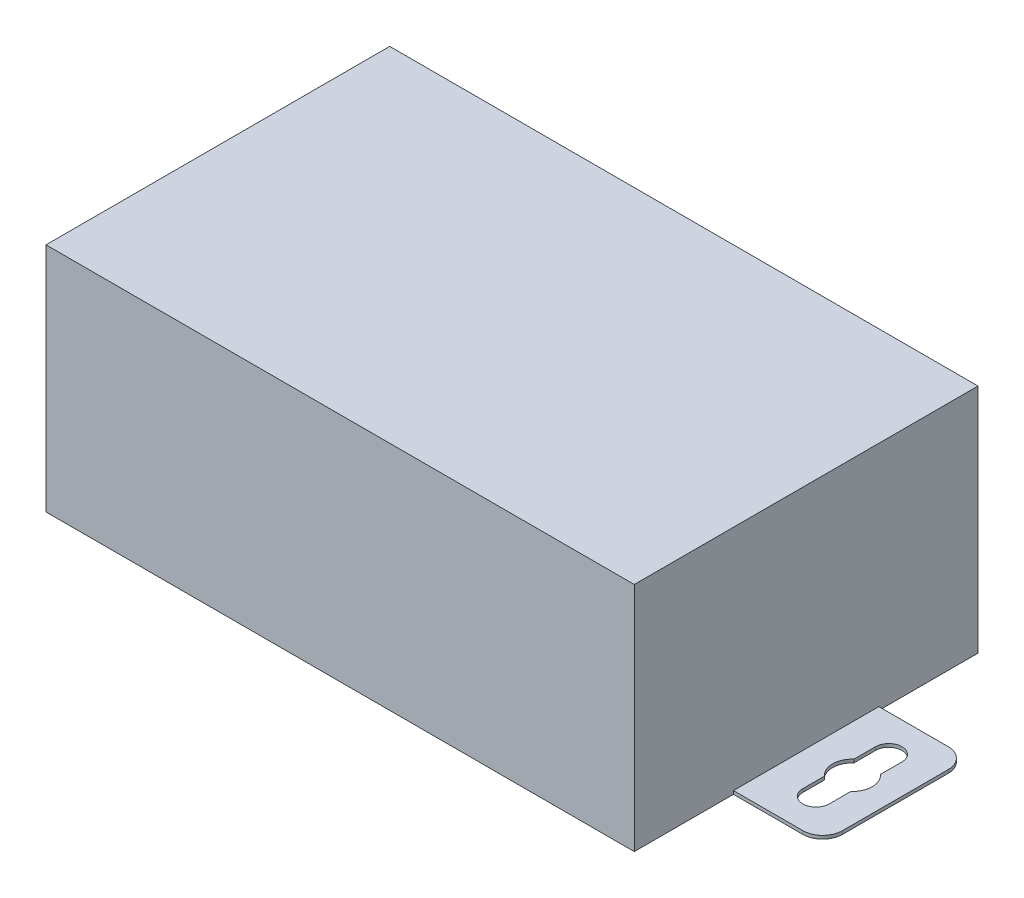
ISO-10303-21;
HEADER;
FILE_DESCRIPTION(('STEP AP214'),'2;1');
FILE_NAME('part.step','',(''),(''),'','','');
FILE_SCHEMA(('AUTOMOTIVE_DESIGN { 1 0 10303 214 1 1 1 1 }'));
ENDSEC;
DATA;
#1=APPLICATION_CONTEXT('core data for automotive mechanical design processes');
#2=APPLICATION_PROTOCOL_DEFINITION('international standard','automotive_design',2000,#1);
#3=PRODUCT_CONTEXT('',#1,'mechanical');
#4=PRODUCT('Part','Part','',(#3));
#5=PRODUCT_RELATED_PRODUCT_CATEGORY('part','',(#4));
#6=PRODUCT_DEFINITION_FORMATION('','',#4);
#7=PRODUCT_DEFINITION_CONTEXT('part definition',#1,'design');
#8=PRODUCT_DEFINITION('design','',#6,#7);
#9=PRODUCT_DEFINITION_SHAPE('','',#8);
#10=(LENGTH_UNIT() NAMED_UNIT(*) SI_UNIT(.MILLI.,.METRE.));
#11=(NAMED_UNIT(*) PLANE_ANGLE_UNIT() SI_UNIT($,.RADIAN.));
#12=(NAMED_UNIT(*) SI_UNIT($,.STERADIAN.) SOLID_ANGLE_UNIT());
#13=UNCERTAINTY_MEASURE_WITH_UNIT(LENGTH_MEASURE(1.E-05),#10,'distance_accuracy_value','');
#14=(GEOMETRIC_REPRESENTATION_CONTEXT(3) GLOBAL_UNCERTAINTY_ASSIGNED_CONTEXT((#13)) GLOBAL_UNIT_ASSIGNED_CONTEXT((#10,
#11,#12)) REPRESENTATION_CONTEXT('',''));
#15=CARTESIAN_POINT('',(0.,0.,0.));
#16=DIRECTION('',(0.,0.,1.));
#17=DIRECTION('',(1.,0.,0.));
#18=AXIS2_PLACEMENT_3D('',#15,#16,#17);
#19=CARTESIAN_POINT('',(0.,35.,0.));
#20=DIRECTION('',(1.,0.,0.));
#21=DIRECTION('',(0.,0.,-1.));
#22=AXIS2_PLACEMENT_3D('',#19,#20,#21);
#23=PLANE('',#22);
#24=DIRECTION('',(0.,0.,1.));
#25=VECTOR('',#24,1.);
#26=CARTESIAN_POINT('',(0.,0.,0.));
#27=LINE('',#26,#25);
#28=CARTESIAN_POINT('',(0.,0.,-52.));
#29=VERTEX_POINT('',#28);
#30=CARTESIAN_POINT('',(0.,0.,-37.));
#31=VERTEX_POINT('',#30);
#32=EDGE_CURVE('E562',#29,#31,#27,.T.);
#33=ORIENTED_EDGE('',*,*,#32,.T.);
#34=DIRECTION('',(0.,1.,0.));
#35=VECTOR('',#34,1.);
#36=CARTESIAN_POINT('',(0.,35.,-37.));
#37=LINE('',#36,#35);
#38=CARTESIAN_POINT('',(0.,0.5,-37.));
#39=VERTEX_POINT('',#38);
#40=EDGE_CURVE('E543',#31,#39,#37,.T.);
#41=ORIENTED_EDGE('',*,*,#40,.T.);
#42=DIRECTION('',(0.,0.,1.));
#43=VECTOR('',#42,1.);
#44=CARTESIAN_POINT('',(0.,0.5,0.));
#45=LINE('',#44,#43);
#46=CARTESIAN_POINT('',(0.,0.5,-15.));
#47=VERTEX_POINT('',#46);
#48=EDGE_CURVE('E47',#39,#47,#45,.T.);
#49=ORIENTED_EDGE('',*,*,#48,.T.);
#50=DIRECTION('',(0.,-1.,0.));
#51=VECTOR('',#50,1.);
#52=CARTESIAN_POINT('',(0.,35.,-15.));
#53=LINE('',#52,#51);
#54=CARTESIAN_POINT('',(0.,0.,-15.));
#55=VERTEX_POINT('',#54);
#56=EDGE_CURVE('E530',#47,#55,#53,.T.);
#57=ORIENTED_EDGE('',*,*,#56,.T.);
#58=CARTESIAN_POINT('',(0.,0.,0.));
#59=VERTEX_POINT('',#58);
#60=EDGE_CURVE('E546',#55,#59,#27,.T.);
#61=ORIENTED_EDGE('',*,*,#60,.T.);
#62=DIRECTION('',(0.,-1.,0.));
#63=VECTOR('',#62,1.);
#64=CARTESIAN_POINT('',(0.,35.,0.));
#65=LINE('',#64,#63);
#66=CARTESIAN_POINT('',(0.,35.,0.));
#67=VERTEX_POINT('',#66);
#68=EDGE_CURVE('E585',#67,#59,#65,.T.);
#69=ORIENTED_EDGE('',*,*,#68,.F.);
#70=DIRECTION('',(0.,0.,1.));
#71=VECTOR('',#70,1.);
#72=CARTESIAN_POINT('',(0.,35.,0.));
#73=LINE('',#72,#71);
#74=CARTESIAN_POINT('',(0.,35.,-52.));
#75=VERTEX_POINT('',#74);
#76=EDGE_CURVE('E547',#75,#67,#73,.T.);
#77=ORIENTED_EDGE('',*,*,#76,.F.);
#78=DIRECTION('',(0.,-1.,0.));
#79=VECTOR('',#78,1.);
#80=CARTESIAN_POINT('',(0.,35.,-52.));
#81=LINE('',#80,#79);
#82=EDGE_CURVE('E561',#75,#29,#81,.T.);
#83=ORIENTED_EDGE('',*,*,#82,.T.);
#84=EDGE_LOOP('',(#33,#41,#49,#57,#61,#69,#77,#83));
#85=FACE_BOUND('',#84,.T.);
#86=ADVANCED_FACE('F39',(#85),#23,.F.);
#87=CARTESIAN_POINT('',(0.,35.,0.));
#88=DIRECTION('',(0.,0.,-1.));
#89=DIRECTION('',(-1.,0.,0.));
#90=AXIS2_PLACEMENT_3D('',#87,#88,#89);
#91=PLANE('',#90);
#92=DIRECTION('',(1.,0.,0.));
#93=VECTOR('',#92,1.);
#94=CARTESIAN_POINT('',(0.,0.,0.));
#95=LINE('',#94,#93);
#96=CARTESIAN_POINT('',(89.,0.,0.));
#97=VERTEX_POINT('',#96);
#98=EDGE_CURVE('E565',#59,#97,#95,.T.);
#99=ORIENTED_EDGE('',*,*,#98,.T.);
#100=DIRECTION('',(0.,-1.,0.));
#101=VECTOR('',#100,1.);
#102=CARTESIAN_POINT('',(89.,35.,0.));
#103=LINE('',#102,#101);
#104=CARTESIAN_POINT('',(89.,35.,0.));
#105=VERTEX_POINT('',#104);
#106=EDGE_CURVE('E581',#105,#97,#103,.T.);
#107=ORIENTED_EDGE('',*,*,#106,.F.);
#108=DIRECTION('',(1.,0.,0.));
#109=VECTOR('',#108,1.);
#110=CARTESIAN_POINT('',(0.,35.,0.));
#111=LINE('',#110,#109);
#112=EDGE_CURVE('E551',#67,#105,#111,.T.);
#113=ORIENTED_EDGE('',*,*,#112,.F.);
#114=ORIENTED_EDGE('',*,*,#68,.T.);
#115=EDGE_LOOP('',(#99,#107,#113,#114));
#116=FACE_BOUND('',#115,.T.);
#117=ADVANCED_FACE('F645',(#116),#91,.F.);
#118=CARTESIAN_POINT('',(89.,35.,0.));
#119=DIRECTION('',(-1.,0.,0.));
#120=DIRECTION('',(0.,0.,1.));
#121=AXIS2_PLACEMENT_3D('',#118,#119,#120);
#122=PLANE('',#121);
#123=DIRECTION('',(0.,0.,1.));
#124=VECTOR('',#123,1.);
#125=CARTESIAN_POINT('',(89.,0.5,0.));
#126=LINE('',#125,#124);
#127=CARTESIAN_POINT('',(89.,0.5,-36.9999999999998));
#128=VERTEX_POINT('',#127);
#129=CARTESIAN_POINT('',(89.,0.5,-14.9999999999995));
#130=VERTEX_POINT('',#129);
#131=EDGE_CURVE('E11',#128,#130,#126,.T.);
#132=ORIENTED_EDGE('',*,*,#131,.F.);
#133=DIRECTION('',(0.,-1.,0.));
#134=VECTOR('',#133,1.);
#135=CARTESIAN_POINT('',(89.,35.,-36.9999999999997));
#136=LINE('',#135,#134);
#137=CARTESIAN_POINT('',(89.,0.,-36.9999999999997));
#138=VERTEX_POINT('',#137);
#139=EDGE_CURVE('E397',#128,#138,#136,.T.);
#140=ORIENTED_EDGE('',*,*,#139,.T.);
#141=DIRECTION('',(0.,0.,-1.));
#142=VECTOR('',#141,1.);
#143=CARTESIAN_POINT('',(89.,0.,0.));
#144=LINE('',#143,#142);
#145=CARTESIAN_POINT('',(89.,0.,-52.));
#146=VERTEX_POINT('',#145);
#147=EDGE_CURVE('E568',#138,#146,#144,.T.);
#148=ORIENTED_EDGE('',*,*,#147,.T.);
#149=DIRECTION('',(0.,-1.,0.));
#150=VECTOR('',#149,1.);
#151=CARTESIAN_POINT('',(89.,35.,-52.));
#152=LINE('',#151,#150);
#153=CARTESIAN_POINT('',(89.,35.,-52.));
#154=VERTEX_POINT('',#153);
#155=EDGE_CURVE('E577',#154,#146,#152,.T.);
#156=ORIENTED_EDGE('',*,*,#155,.F.);
#157=DIRECTION('',(0.,0.,-1.));
#158=VECTOR('',#157,1.);
#159=CARTESIAN_POINT('',(89.,35.,0.));
#160=LINE('',#159,#158);
#161=EDGE_CURVE('E555',#105,#154,#160,.T.);
#162=ORIENTED_EDGE('',*,*,#161,.F.);
#163=ORIENTED_EDGE('',*,*,#106,.T.);
#164=CARTESIAN_POINT('',(89.,0.,-14.9999999999997));
#165=VERTEX_POINT('',#164);
#166=EDGE_CURVE('E569',#97,#165,#144,.T.);
#167=ORIENTED_EDGE('',*,*,#166,.T.);
#168=DIRECTION('',(0.,1.,0.));
#169=VECTOR('',#168,1.);
#170=CARTESIAN_POINT('',(89.,35.,-14.9999999999997));
#171=LINE('',#170,#169);
#172=EDGE_CURVE('E54',#165,#130,#171,.T.);
#173=ORIENTED_EDGE('',*,*,#172,.T.);
#174=EDGE_LOOP('',(#132,#140,#148,#156,#162,#163,#167,#173));
#175=FACE_BOUND('',#174,.T.);
#176=ADVANCED_FACE('F617',(#175),#122,.F.);
#177=CARTESIAN_POINT('',(0.,35.,-52.));
#178=DIRECTION('',(0.,0.,1.));
#179=DIRECTION('',(1.,0.,0.));
#180=AXIS2_PLACEMENT_3D('',#177,#178,#179);
#181=PLANE('',#180);
#182=DIRECTION('',(-1.,0.,0.));
#183=VECTOR('',#182,1.);
#184=CARTESIAN_POINT('',(0.,0.,-52.));
#185=LINE('',#184,#183);
#186=EDGE_CURVE('E552',#146,#29,#185,.T.);
#187=ORIENTED_EDGE('',*,*,#186,.T.);
#188=ORIENTED_EDGE('',*,*,#82,.F.);
#189=DIRECTION('',(-1.,0.,0.));
#190=VECTOR('',#189,1.);
#191=CARTESIAN_POINT('',(0.,35.,-52.));
#192=LINE('',#191,#190);
#193=EDGE_CURVE('E558',#154,#75,#192,.T.);
#194=ORIENTED_EDGE('',*,*,#193,.F.);
#195=ORIENTED_EDGE('',*,*,#155,.T.);
#196=EDGE_LOOP('',(#187,#188,#194,#195));
#197=FACE_BOUND('',#196,.T.);
#198=ADVANCED_FACE('F623',(#197),#181,.F.);
#199=CARTESIAN_POINT('',(0.,35.,0.));
#200=DIRECTION('',(0.,-1.,0.));
#201=DIRECTION('',(0.,0.,-1.));
#202=AXIS2_PLACEMENT_3D('',#199,#200,#201);
#203=PLANE('',#202);
#204=ORIENTED_EDGE('',*,*,#76,.T.);
#205=ORIENTED_EDGE('',*,*,#112,.T.);
#206=ORIENTED_EDGE('',*,*,#161,.T.);
#207=ORIENTED_EDGE('',*,*,#193,.T.);
#208=EDGE_LOOP('',(#204,#205,#206,#207));
#209=FACE_BOUND('',#208,.T.);
#210=ADVANCED_FACE('F657',(#209),#203,.F.);
#211=CARTESIAN_POINT('',(0.,0.,0.));
#212=DIRECTION('',(0.,-1.,0.));
#213=DIRECTION('',(0.,0.,-1.));
#214=AXIS2_PLACEMENT_3D('',#211,#212,#213);
#215=PLANE('',#214);
#216=ORIENTED_EDGE('',*,*,#147,.F.);
#217=DIRECTION('',(1.,0.,0.));
#218=VECTOR('',#217,1.);
#219=CARTESIAN_POINT('',(99.5000000000002,0.,-36.9999999999996));
#220=LINE('',#219,#218);
#221=CARTESIAN_POINT('',(99.5000000000002,0.,-36.9999999999996));
#222=VERTEX_POINT('',#221);
#223=EDGE_CURVE('E327',#138,#222,#220,.T.);
#224=ORIENTED_EDGE('',*,*,#223,.T.);
#225=CARTESIAN_POINT('',(99.5000000000002,0.,-33.9999999999996));
#226=DIRECTION('',(0.,-1.,0.));
#227=DIRECTION('',(0.,0.,-1.));
#228=AXIS2_PLACEMENT_3D('',#225,#226,#227);
#229=CIRCLE('',#228,3.00000000000001);
#230=CARTESIAN_POINT('',(102.5,0.,-33.9999999999995));
#231=VERTEX_POINT('',#230);
#232=EDGE_CURVE('E368',#222,#231,#229,.T.);
#233=ORIENTED_EDGE('',*,*,#232,.T.);
#234=DIRECTION('',(0.,0.,1.));
#235=VECTOR('',#234,1.);
#236=CARTESIAN_POINT('',(102.5,0.,-33.9999999999995));
#237=LINE('',#236,#235);
#238=CARTESIAN_POINT('',(102.5,0.,-17.9999999999996));
#239=VERTEX_POINT('',#238);
#240=EDGE_CURVE('E372',#231,#239,#237,.T.);
#241=ORIENTED_EDGE('',*,*,#240,.T.);
#242=CARTESIAN_POINT('',(99.5000000000001,0.,-17.9999999999996));
#243=DIRECTION('',(0.,-1.,0.));
#244=DIRECTION('',(0.,0.,-1.));
#245=AXIS2_PLACEMENT_3D('',#242,#243,#244);
#246=CIRCLE('',#245,3.00000000000001);
#247=CARTESIAN_POINT('',(99.5000000000001,0.,-14.9999999999996));
#248=VERTEX_POINT('',#247);
#249=EDGE_CURVE('E376',#239,#248,#246,.T.);
#250=ORIENTED_EDGE('',*,*,#249,.T.);
#251=DIRECTION('',(-1.,0.,0.));
#252=VECTOR('',#251,1.);
#253=CARTESIAN_POINT('',(99.5000000000001,0.,-14.9999999999996));
#254=LINE('',#253,#252);
#255=EDGE_CURVE('E349',#248,#165,#254,.T.);
#256=ORIENTED_EDGE('',*,*,#255,.T.);
#257=ORIENTED_EDGE('',*,*,#166,.F.);
#258=ORIENTED_EDGE('',*,*,#98,.F.);
#259=ORIENTED_EDGE('',*,*,#60,.F.);
#260=DIRECTION('',(-1.,0.,0.));
#261=VECTOR('',#260,1.);
#262=CARTESIAN_POINT('',(-10.5,0.,-15.));
#263=LINE('',#262,#261);
#264=CARTESIAN_POINT('',(-10.5,0.,-15.));
#265=VERTEX_POINT('',#264);
#266=EDGE_CURVE('E467',#55,#265,#263,.T.);
#267=ORIENTED_EDGE('',*,*,#266,.T.);
#268=CARTESIAN_POINT('',(-10.5,0.,-18.));
#269=DIRECTION('',(0.,-1.,0.));
#270=DIRECTION('',(0.,0.,1.));
#271=AXIS2_PLACEMENT_3D('',#268,#269,#270);
#272=CIRCLE('',#271,3.);
#273=CARTESIAN_POINT('',(-13.5,0.,-18.));
#274=VERTEX_POINT('',#273);
#275=EDGE_CURVE('E512',#265,#274,#272,.T.);
#276=ORIENTED_EDGE('',*,*,#275,.T.);
#277=DIRECTION('',(0.,0.,-1.));
#278=VECTOR('',#277,1.);
#279=CARTESIAN_POINT('',(-13.5,0.,-34.));
#280=LINE('',#279,#278);
#281=CARTESIAN_POINT('',(-13.5,0.,-34.));
#282=VERTEX_POINT('',#281);
#283=EDGE_CURVE('E516',#274,#282,#280,.T.);
#284=ORIENTED_EDGE('',*,*,#283,.T.);
#285=CARTESIAN_POINT('',(-10.5,0.,-34.));
#286=DIRECTION('',(0.,-1.,0.));
#287=DIRECTION('',(0.,0.,1.));
#288=AXIS2_PLACEMENT_3D('',#285,#286,#287);
#289=CIRCLE('',#288,3.);
#290=CARTESIAN_POINT('',(-10.5,0.,-37.));
#291=VERTEX_POINT('',#290);
#292=EDGE_CURVE('E520',#282,#291,#289,.T.);
#293=ORIENTED_EDGE('',*,*,#292,.T.);
#294=DIRECTION('',(1.,0.,0.));
#295=VECTOR('',#294,1.);
#296=CARTESIAN_POINT('',(-10.5,0.,-37.));
#297=LINE('',#296,#295);
#298=EDGE_CURVE('E493',#291,#31,#297,.T.);
#299=ORIENTED_EDGE('',*,*,#298,.T.);
#300=ORIENTED_EDGE('',*,*,#32,.F.);
#301=ORIENTED_EDGE('',*,*,#186,.F.);
#302=EDGE_LOOP('',(#216,#224,#233,#241,#250,#256,#257,#258,#259,#267,#276,#284,#293,#299,#300,#301));
#303=FACE_BOUND('',#302,.T.);
#304=DIRECTION('',(0.,0.,-1.));
#305=VECTOR('',#304,1.);
#306=CARTESIAN_POINT('',(-9.,0.,-20.5));
#307=LINE('',#306,#305);
#308=CARTESIAN_POINT('',(-9.,0.,-20.5));
#309=VERTEX_POINT('',#308);
#310=CARTESIAN_POINT('',(-9.,0.,-23.7639320225002));
#311=VERTEX_POINT('',#310);
#312=EDGE_CURVE('E437',#309,#311,#307,.T.);
#313=ORIENTED_EDGE('',*,*,#312,.F.);
#314=CARTESIAN_POINT('',(-7.,0.,-20.4999999999998));
#315=DIRECTION('',(0.,-1.,0.));
#316=DIRECTION('',(0.,0.,-1.));
#317=AXIS2_PLACEMENT_3D('',#314,#315,#316);
#318=CIRCLE('',#317,2.);
#319=CARTESIAN_POINT('',(-5.,0.,-20.5));
#320=VERTEX_POINT('',#319);
#321=EDGE_CURVE('E400',#320,#309,#318,.T.);
#322=ORIENTED_EDGE('',*,*,#321,.F.);
#323=DIRECTION('',(0.,0.,1.));
#324=VECTOR('',#323,1.);
#325=CARTESIAN_POINT('',(-5.,0.,-20.5));
#326=LINE('',#325,#324);
#327=CARTESIAN_POINT('',(-5.,0.,-23.7639320225002));
#328=VERTEX_POINT('',#327);
#329=EDGE_CURVE('E406',#328,#320,#326,.T.);
#330=ORIENTED_EDGE('',*,*,#329,.F.);
#331=CARTESIAN_POINT('',(-7.,0.,-26.));
#332=DIRECTION('',(0.,-1.,0.));
#333=DIRECTION('',(0.,0.,-1.));
#334=AXIS2_PLACEMENT_3D('',#331,#332,#333);
#335=CIRCLE('',#334,3.);
#336=CARTESIAN_POINT('',(-4.99999999999865,0.,-28.2360679774986));
#337=VERTEX_POINT('',#336);
#338=EDGE_CURVE('E457',#337,#328,#335,.T.);
#339=ORIENTED_EDGE('',*,*,#338,.F.);
#340=DIRECTION('',(4.13493557771965E-13,0.,1.));
#341=VECTOR('',#340,1.);
#342=CARTESIAN_POINT('',(-4.99999999999865,0.,-28.2360679774986));
#343=LINE('',#342,#341);
#344=CARTESIAN_POINT('',(-5.,0.,-31.5));
#345=VERTEX_POINT('',#344);
#346=EDGE_CURVE('E453',#345,#337,#343,.T.);
#347=ORIENTED_EDGE('',*,*,#346,.F.);
#348=CARTESIAN_POINT('',(-7.,0.,-31.5));
#349=DIRECTION('',(0.,-1.,0.));
#350=DIRECTION('',(0.,0.,-1.));
#351=AXIS2_PLACEMENT_3D('',#348,#349,#350);
#352=CIRCLE('',#351,2.);
#353=CARTESIAN_POINT('',(-9.,0.,-31.5));
#354=VERTEX_POINT('',#353);
#355=EDGE_CURVE('E449',#354,#345,#352,.T.);
#356=ORIENTED_EDGE('',*,*,#355,.F.);
#357=DIRECTION('',(0.,0.,-1.));
#358=VECTOR('',#357,1.);
#359=CARTESIAN_POINT('',(-9.,0.,-28.2360679774998));
#360=LINE('',#359,#358);
#361=CARTESIAN_POINT('',(-9.,0.,-28.2360679774998));
#362=VERTEX_POINT('',#361);
#363=EDGE_CURVE('E445',#362,#354,#360,.T.);
#364=ORIENTED_EDGE('',*,*,#363,.F.);
#365=CARTESIAN_POINT('',(-7.,0.,-26.));
#366=DIRECTION('',(0.,-1.,0.));
#367=DIRECTION('',(0.,0.,-1.));
#368=AXIS2_PLACEMENT_3D('',#365,#366,#367);
#369=CIRCLE('',#368,3.);
#370=EDGE_CURVE('E441',#311,#362,#369,.T.);
#371=ORIENTED_EDGE('',*,*,#370,.F.);
#372=EDGE_LOOP('',(#313,#322,#330,#339,#347,#356,#364,#371));
#373=FACE_BOUND('',#372,.T.);
#374=CARTESIAN_POINT('',(96.0000000000002,0.,-25.9999999999996));
#375=DIRECTION('',(0.,-1.,0.));
#376=DIRECTION('',(0.,0.,1.));
#377=AXIS2_PLACEMENT_3D('',#374,#375,#376);
#378=CIRCLE('',#377,3.);
#379=CARTESIAN_POINT('',(94.0000000000002,0.,-23.7639320224998));
#380=VERTEX_POINT('',#379);
#381=CARTESIAN_POINT('',(93.9999999999988,0.,-28.2360679774981));
#382=VERTEX_POINT('',#381);
#383=EDGE_CURVE('E252',#380,#382,#378,.T.);
#384=ORIENTED_EDGE('',*,*,#383,.F.);
#385=DIRECTION('',(0.,0.,-1.));
#386=VECTOR('',#385,1.);
#387=CARTESIAN_POINT('',(94.0000000000001,0.,-20.4999999999996));
#388=LINE('',#387,#386);
#389=CARTESIAN_POINT('',(94.0000000000001,0.,-20.4999999999996));
#390=VERTEX_POINT('',#389);
#391=EDGE_CURVE('E274',#390,#380,#388,.T.);
#392=ORIENTED_EDGE('',*,*,#391,.F.);
#393=CARTESIAN_POINT('',(96.0000000000001,0.,-20.4999999999993));
#394=DIRECTION('',(0.,-1.,0.));
#395=DIRECTION('',(0.,0.,1.));
#396=AXIS2_PLACEMENT_3D('',#393,#394,#395);
#397=CIRCLE('',#396,2.00000000000001);
#398=CARTESIAN_POINT('',(98.0000000000001,0.,-20.4999999999996));
#399=VERTEX_POINT('',#398);
#400=EDGE_CURVE('E278',#399,#390,#397,.T.);
#401=ORIENTED_EDGE('',*,*,#400,.F.);
#402=DIRECTION('',(0.,0.,1.));
#403=VECTOR('',#402,1.);
#404=CARTESIAN_POINT('',(98.0000000000001,0.,-20.4999999999996));
#405=LINE('',#404,#403);
#406=CARTESIAN_POINT('',(98.0000000000002,0.,-23.7639320224998));
#407=VERTEX_POINT('',#406);
#408=EDGE_CURVE('E317',#407,#399,#405,.T.);
#409=ORIENTED_EDGE('',*,*,#408,.F.);
#410=CARTESIAN_POINT('',(96.0000000000002,0.,-25.9999999999996));
#411=DIRECTION('',(0.,-1.,0.));
#412=DIRECTION('',(0.,0.,1.));
#413=AXIS2_PLACEMENT_3D('',#410,#411,#412);
#414=CIRCLE('',#413,3.00000000000001);
#415=CARTESIAN_POINT('',(98.0000000000002,0.,-28.2360679774993));
#416=VERTEX_POINT('',#415);
#417=EDGE_CURVE('E313',#416,#407,#414,.T.);
#418=ORIENTED_EDGE('',*,*,#417,.F.);
#419=DIRECTION('',(0.,0.,1.));
#420=VECTOR('',#419,1.);
#421=CARTESIAN_POINT('',(98.0000000000002,0.,-28.2360679774993));
#422=LINE('',#421,#420);
#423=CARTESIAN_POINT('',(98.0000000000002,0.,-31.4999999999996));
#424=VERTEX_POINT('',#423);
#425=EDGE_CURVE('E309',#424,#416,#422,.T.);
#426=ORIENTED_EDGE('',*,*,#425,.F.);
#427=CARTESIAN_POINT('',(96.0000000000002,0.,-31.4999999999996));
#428=DIRECTION('',(0.,-1.,0.));
#429=DIRECTION('',(0.,0.,1.));
#430=AXIS2_PLACEMENT_3D('',#427,#428,#429);
#431=CIRCLE('',#430,2.00000000000001);
#432=CARTESIAN_POINT('',(94.0000000000002,0.,-31.4999999999996));
#433=VERTEX_POINT('',#432);
#434=EDGE_CURVE('E305',#433,#424,#431,.T.);
#435=ORIENTED_EDGE('',*,*,#434,.F.);
#436=DIRECTION('',(4.20934315880972E-13,0.,-1.));
#437=VECTOR('',#436,1.);
#438=CARTESIAN_POINT('',(93.9999999999988,0.,-28.2360679774981));
#439=LINE('',#438,#437);
#440=EDGE_CURVE('E302',#382,#433,#439,.T.);
#441=ORIENTED_EDGE('',*,*,#440,.F.);
#442=EDGE_LOOP('',(#384,#392,#401,#409,#418,#426,#435,#441));
#443=FACE_BOUND('',#442,.T.);
#444=ADVANCED_FACE('F609',(#303,#373,#443),#215,.T.);
#445=CARTESIAN_POINT('',(-10.5,0.5,-18.));
#446=DIRECTION('',(0.,1.,0.));
#447=DIRECTION('',(0.,0.,1.));
#448=AXIS2_PLACEMENT_3D('',#445,#446,#447);
#449=PLANE('',#448);
#450=CARTESIAN_POINT('',(-7.,0.5,-20.4999999999998));
#451=DIRECTION('',(0.,-1.,0.));
#452=DIRECTION('',(0.,0.,-1.));
#453=AXIS2_PLACEMENT_3D('',#450,#451,#452);
#454=CIRCLE('',#453,2.);
#455=CARTESIAN_POINT('',(-5.,0.5,-20.5));
#456=VERTEX_POINT('',#455);
#457=CARTESIAN_POINT('',(-9.,0.5,-20.5));
#458=VERTEX_POINT('',#457);
#459=EDGE_CURVE('E401',#456,#458,#454,.T.);
#460=ORIENTED_EDGE('',*,*,#459,.T.);
#461=DIRECTION('',(0.,0.,-1.));
#462=VECTOR('',#461,1.);
#463=CARTESIAN_POINT('',(-9.,0.5,-20.5));
#464=LINE('',#463,#462);
#465=CARTESIAN_POINT('',(-9.,0.5,-23.7639320225002));
#466=VERTEX_POINT('',#465);
#467=EDGE_CURVE('E405',#458,#466,#464,.T.);
#468=ORIENTED_EDGE('',*,*,#467,.T.);
#469=CARTESIAN_POINT('',(-7.,0.5,-26.));
#470=DIRECTION('',(0.,-1.,0.));
#471=DIRECTION('',(0.,0.,-1.));
#472=AXIS2_PLACEMENT_3D('',#469,#470,#471);
#473=CIRCLE('',#472,3.);
#474=CARTESIAN_POINT('',(-9.,0.5,-28.2360679774998));
#475=VERTEX_POINT('',#474);
#476=EDGE_CURVE('E410',#466,#475,#473,.T.);
#477=ORIENTED_EDGE('',*,*,#476,.T.);
#478=DIRECTION('',(0.,0.,-1.));
#479=VECTOR('',#478,1.);
#480=CARTESIAN_POINT('',(-9.,0.5,-28.2360679774998));
#481=LINE('',#480,#479);
#482=CARTESIAN_POINT('',(-9.,0.5,-31.5));
#483=VERTEX_POINT('',#482);
#484=EDGE_CURVE('E414',#475,#483,#481,.T.);
#485=ORIENTED_EDGE('',*,*,#484,.T.);
#486=CARTESIAN_POINT('',(-7.,0.5,-31.5));
#487=DIRECTION('',(0.,-1.,0.));
#488=DIRECTION('',(0.,0.,-1.));
#489=AXIS2_PLACEMENT_3D('',#486,#487,#488);
#490=CIRCLE('',#489,2.);
#491=CARTESIAN_POINT('',(-5.,0.5,-31.5));
#492=VERTEX_POINT('',#491);
#493=EDGE_CURVE('E418',#483,#492,#490,.T.);
#494=ORIENTED_EDGE('',*,*,#493,.T.);
#495=DIRECTION('',(4.13493557771965E-13,0.,1.));
#496=VECTOR('',#495,1.);
#497=CARTESIAN_POINT('',(-4.99999999999865,0.5,-28.2360679774986));
#498=LINE('',#497,#496);
#499=CARTESIAN_POINT('',(-4.99999999999865,0.5,-28.2360679774986));
#500=VERTEX_POINT('',#499);
#501=EDGE_CURVE('E422',#492,#500,#498,.T.);
#502=ORIENTED_EDGE('',*,*,#501,.T.);
#503=CARTESIAN_POINT('',(-7.,0.5,-26.));
#504=DIRECTION('',(0.,-1.,0.));
#505=DIRECTION('',(0.,0.,-1.));
#506=AXIS2_PLACEMENT_3D('',#503,#504,#505);
#507=CIRCLE('',#506,3.);
#508=CARTESIAN_POINT('',(-5.,0.5,-23.7639320225002));
#509=VERTEX_POINT('',#508);
#510=EDGE_CURVE('E426',#500,#509,#507,.T.);
#511=ORIENTED_EDGE('',*,*,#510,.T.);
#512=DIRECTION('',(0.,0.,1.));
#513=VECTOR('',#512,1.);
#514=CARTESIAN_POINT('',(-5.,0.5,-20.5));
#515=LINE('',#514,#513);
#516=EDGE_CURVE('E430',#509,#456,#515,.T.);
#517=ORIENTED_EDGE('',*,*,#516,.T.);
#518=EDGE_LOOP('',(#460,#468,#477,#485,#494,#502,#511,#517));
#519=FACE_BOUND('',#518,.T.);
#520=ORIENTED_EDGE('',*,*,#48,.F.);
#521=DIRECTION('',(1.,0.,0.));
#522=VECTOR('',#521,1.);
#523=CARTESIAN_POINT('',(-10.5,0.5,-37.));
#524=LINE('',#523,#522);
#525=CARTESIAN_POINT('',(-10.5,0.5,-37.));
#526=VERTEX_POINT('',#525);
#527=EDGE_CURVE('E505',#526,#39,#524,.T.);
#528=ORIENTED_EDGE('',*,*,#527,.F.);
#529=CARTESIAN_POINT('',(-10.5,0.5,-34.));
#530=DIRECTION('',(0.,-1.,0.));
#531=DIRECTION('',(0.,0.,1.));
#532=AXIS2_PLACEMENT_3D('',#529,#530,#531);
#533=CIRCLE('',#532,3.);
#534=CARTESIAN_POINT('',(-13.5,0.5,-34.));
#535=VERTEX_POINT('',#534);
#536=EDGE_CURVE('E501',#535,#526,#533,.T.);
#537=ORIENTED_EDGE('',*,*,#536,.F.);
#538=DIRECTION('',(0.,0.,-1.));
#539=VECTOR('',#538,1.);
#540=CARTESIAN_POINT('',(-13.5,0.5,-34.));
#541=LINE('',#540,#539);
#542=CARTESIAN_POINT('',(-13.5,0.5,-18.));
#543=VERTEX_POINT('',#542);
#544=EDGE_CURVE('E497',#543,#535,#541,.T.);
#545=ORIENTED_EDGE('',*,*,#544,.F.);
#546=CARTESIAN_POINT('',(-10.5,0.5,-18.));
#547=DIRECTION('',(0.,-1.,0.));
#548=DIRECTION('',(0.,0.,1.));
#549=AXIS2_PLACEMENT_3D('',#546,#547,#548);
#550=CIRCLE('',#549,3.);
#551=CARTESIAN_POINT('',(-10.5,0.5,-15.));
#552=VERTEX_POINT('',#551);
#553=EDGE_CURVE('E492',#552,#543,#550,.T.);
#554=ORIENTED_EDGE('',*,*,#553,.F.);
#555=DIRECTION('',(-1.,0.,0.));
#556=VECTOR('',#555,1.);
#557=CARTESIAN_POINT('',(-10.5,0.5,-15.));
#558=LINE('',#557,#556);
#559=EDGE_CURVE('E489',#47,#552,#558,.T.);
#560=ORIENTED_EDGE('',*,*,#559,.F.);
#561=EDGE_LOOP('',(#520,#528,#537,#545,#554,#560));
#562=FACE_BOUND('',#561,.T.);
#563=ADVANCED_FACE('F601',(#519,#562),#449,.T.);
#564=CARTESIAN_POINT('',(-10.5,0.5,-37.));
#565=DIRECTION('',(0.,0.,-1.));
#566=DIRECTION('',(-1.,0.,0.));
#567=AXIS2_PLACEMENT_3D('',#564,#565,#566);
#568=PLANE('',#567);
#569=ORIENTED_EDGE('',*,*,#40,.F.);
#570=ORIENTED_EDGE('',*,*,#298,.F.);
#571=DIRECTION('',(0.,-1.,0.));
#572=VECTOR('',#571,1.);
#573=CARTESIAN_POINT('',(-10.5,0.5,-37.));
#574=LINE('',#573,#572);
#575=EDGE_CURVE('E527',#526,#291,#574,.T.);
#576=ORIENTED_EDGE('',*,*,#575,.F.);
#577=ORIENTED_EDGE('',*,*,#527,.T.);
#578=EDGE_LOOP('',(#569,#570,#576,#577));
#579=FACE_BOUND('',#578,.T.);
#580=ADVANCED_FACE('F629',(#579),#568,.T.);
#581=CARTESIAN_POINT('',(-10.5,0.5,-15.));
#582=DIRECTION('',(0.,0.,1.));
#583=DIRECTION('',(1.,0.,0.));
#584=AXIS2_PLACEMENT_3D('',#581,#582,#583);
#585=PLANE('',#584);
#586=ORIENTED_EDGE('',*,*,#56,.F.);
#587=ORIENTED_EDGE('',*,*,#559,.T.);
#588=DIRECTION('',(0.,-1.,0.));
#589=VECTOR('',#588,1.);
#590=CARTESIAN_POINT('',(-10.5,0.5,-15.));
#591=LINE('',#590,#589);
#592=EDGE_CURVE('E509',#552,#265,#591,.T.);
#593=ORIENTED_EDGE('',*,*,#592,.T.);
#594=ORIENTED_EDGE('',*,*,#266,.F.);
#595=EDGE_LOOP('',(#586,#587,#593,#594));
#596=FACE_BOUND('',#595,.T.);
#597=ADVANCED_FACE('F598',(#596),#585,.T.);
#598=CARTESIAN_POINT('',(-10.5,0.5,-34.));
#599=DIRECTION('',(0.,-1.,0.));
#600=DIRECTION('',(0.,0.,-1.));
#601=AXIS2_PLACEMENT_3D('',#598,#599,#600);
#602=CYLINDRICAL_SURFACE('',#601,3.);
#603=ORIENTED_EDGE('',*,*,#292,.F.);
#604=DIRECTION('',(0.,-1.,0.));
#605=VECTOR('',#604,1.);
#606=CARTESIAN_POINT('',(-13.5,0.5,-34.));
#607=LINE('',#606,#605);
#608=EDGE_CURVE('E531',#535,#282,#607,.T.);
#609=ORIENTED_EDGE('',*,*,#608,.F.);
#610=ORIENTED_EDGE('',*,*,#536,.T.);
#611=ORIENTED_EDGE('',*,*,#575,.T.);
#612=EDGE_LOOP('',(#603,#609,#610,#611));
#613=FACE_BOUND('',#612,.T.);
#614=ADVANCED_FACE('F634',(#613),#602,.T.);
#615=CARTESIAN_POINT('',(-13.5,0.5,-34.));
#616=DIRECTION('',(-1.,0.,0.));
#617=DIRECTION('',(0.,0.,1.));
#618=AXIS2_PLACEMENT_3D('',#615,#616,#617);
#619=PLANE('',#618);
#620=ORIENTED_EDGE('',*,*,#283,.F.);
#621=DIRECTION('',(0.,-1.,0.));
#622=VECTOR('',#621,1.);
#623=CARTESIAN_POINT('',(-13.5,0.5,-18.));
#624=LINE('',#623,#622);
#625=EDGE_CURVE('E534',#543,#274,#624,.T.);
#626=ORIENTED_EDGE('',*,*,#625,.F.);
#627=ORIENTED_EDGE('',*,*,#544,.T.);
#628=ORIENTED_EDGE('',*,*,#608,.T.);
#629=EDGE_LOOP('',(#620,#626,#627,#628));
#630=FACE_BOUND('',#629,.T.);
#631=ADVANCED_FACE('F632',(#630),#619,.T.);
#632=CARTESIAN_POINT('',(-10.5,0.5,-18.));
#633=DIRECTION('',(0.,-1.,0.));
#634=DIRECTION('',(0.,0.,-1.));
#635=AXIS2_PLACEMENT_3D('',#632,#633,#634);
#636=CYLINDRICAL_SURFACE('',#635,3.);
#637=ORIENTED_EDGE('',*,*,#275,.F.);
#638=ORIENTED_EDGE('',*,*,#592,.F.);
#639=ORIENTED_EDGE('',*,*,#553,.T.);
#640=ORIENTED_EDGE('',*,*,#625,.T.);
#641=EDGE_LOOP('',(#637,#638,#639,#640));
#642=FACE_BOUND('',#641,.T.);
#643=ADVANCED_FACE('F606',(#642),#636,.T.);
#644=CARTESIAN_POINT('',(-7.,0.5,-20.4999999999998));
#645=DIRECTION('',(0.,-1.,0.));
#646=DIRECTION('',(0.,0.,-1.));
#647=AXIS2_PLACEMENT_3D('',#644,#645,#646);
#648=CYLINDRICAL_SURFACE('',#647,2.);
#649=ORIENTED_EDGE('',*,*,#321,.T.);
#650=DIRECTION('',(0.,-1.,0.));
#651=VECTOR('',#650,1.);
#652=CARTESIAN_POINT('',(-9.,0.5,-20.5));
#653=LINE('',#652,#651);
#654=EDGE_CURVE('E434',#458,#309,#653,.T.);
#655=ORIENTED_EDGE('',*,*,#654,.F.);
#656=ORIENTED_EDGE('',*,*,#459,.F.);
#657=DIRECTION('',(0.,-1.,0.));
#658=VECTOR('',#657,1.);
#659=CARTESIAN_POINT('',(-5.,0.5,-20.5));
#660=LINE('',#659,#658);
#661=EDGE_CURVE('E464',#456,#320,#660,.T.);
#662=ORIENTED_EDGE('',*,*,#661,.T.);
#663=EDGE_LOOP('',(#649,#655,#656,#662));
#664=FACE_BOUND('',#663,.T.);
#665=ADVANCED_FACE('F664',(#664),#648,.F.);
#666=CARTESIAN_POINT('',(-5.,0.5,-20.5));
#667=DIRECTION('',(1.,0.,0.));
#668=DIRECTION('',(0.,0.,-1.));
#669=AXIS2_PLACEMENT_3D('',#666,#667,#668);
#670=PLANE('',#669);
#671=ORIENTED_EDGE('',*,*,#329,.T.);
#672=ORIENTED_EDGE('',*,*,#661,.F.);
#673=ORIENTED_EDGE('',*,*,#516,.F.);
#674=DIRECTION('',(0.,-1.,0.));
#675=VECTOR('',#674,1.);
#676=CARTESIAN_POINT('',(-5.,0.5,-23.7639320225002));
#677=LINE('',#676,#675);
#678=EDGE_CURVE('E468',#509,#328,#677,.T.);
#679=ORIENTED_EDGE('',*,*,#678,.T.);
#680=EDGE_LOOP('',(#671,#672,#673,#679));
#681=FACE_BOUND('',#680,.T.);
#682=ADVANCED_FACE('F668',(#681),#670,.F.);
#683=CARTESIAN_POINT('',(-7.,0.5,-26.));
#684=DIRECTION('',(0.,-1.,0.));
#685=DIRECTION('',(0.,0.,-1.));
#686=AXIS2_PLACEMENT_3D('',#683,#684,#685);
#687=CYLINDRICAL_SURFACE('',#686,3.);
#688=ORIENTED_EDGE('',*,*,#338,.T.);
#689=ORIENTED_EDGE('',*,*,#678,.F.);
#690=ORIENTED_EDGE('',*,*,#510,.F.);
#691=DIRECTION('',(0.,-1.,0.));
#692=VECTOR('',#691,1.);
#693=CARTESIAN_POINT('',(-4.99999999999865,0.5,-28.2360679774986));
#694=LINE('',#693,#692);
#695=EDGE_CURVE('E471',#500,#337,#694,.T.);
#696=ORIENTED_EDGE('',*,*,#695,.T.);
#697=EDGE_LOOP('',(#688,#689,#690,#696));
#698=FACE_BOUND('',#697,.T.);
#699=ADVANCED_FACE('F674',(#698),#687,.F.);
#700=CARTESIAN_POINT('',(-4.99999999999865,0.5,-28.2360679774986));
#701=DIRECTION('',(1.,0.,-4.13493557771965E-13));
#702=DIRECTION('',(-4.13493557771965E-13,0.,-1.));
#703=AXIS2_PLACEMENT_3D('',#700,#701,#702);
#704=PLANE('',#703);
#705=ORIENTED_EDGE('',*,*,#346,.T.);
#706=ORIENTED_EDGE('',*,*,#695,.F.);
#707=ORIENTED_EDGE('',*,*,#501,.F.);
#708=DIRECTION('',(0.,-1.,0.));
#709=VECTOR('',#708,1.);
#710=CARTESIAN_POINT('',(-5.,0.5,-31.5));
#711=LINE('',#710,#709);
#712=EDGE_CURVE('E474',#492,#345,#711,.T.);
#713=ORIENTED_EDGE('',*,*,#712,.T.);
#714=EDGE_LOOP('',(#705,#706,#707,#713));
#715=FACE_BOUND('',#714,.T.);
#716=ADVANCED_FACE('F725',(#715),#704,.F.);
#717=CARTESIAN_POINT('',(-7.,0.5,-31.5));
#718=DIRECTION('',(0.,-1.,0.));
#719=DIRECTION('',(0.,0.,-1.));
#720=AXIS2_PLACEMENT_3D('',#717,#718,#719);
#721=CYLINDRICAL_SURFACE('',#720,2.);
#722=ORIENTED_EDGE('',*,*,#355,.T.);
#723=ORIENTED_EDGE('',*,*,#712,.F.);
#724=ORIENTED_EDGE('',*,*,#493,.F.);
#725=DIRECTION('',(0.,-1.,0.));
#726=VECTOR('',#725,1.);
#727=CARTESIAN_POINT('',(-9.,0.5,-31.5));
#728=LINE('',#727,#726);
#729=EDGE_CURVE('E477',#483,#354,#728,.T.);
#730=ORIENTED_EDGE('',*,*,#729,.T.);
#731=EDGE_LOOP('',(#722,#723,#724,#730));
#732=FACE_BOUND('',#731,.T.);
#733=ADVANCED_FACE('F735',(#732),#721,.F.);
#734=CARTESIAN_POINT('',(-9.,0.5,-28.2360679774998));
#735=DIRECTION('',(-1.,0.,0.));
#736=DIRECTION('',(0.,0.,1.));
#737=AXIS2_PLACEMENT_3D('',#734,#735,#736);
#738=PLANE('',#737);
#739=ORIENTED_EDGE('',*,*,#363,.T.);
#740=ORIENTED_EDGE('',*,*,#729,.F.);
#741=ORIENTED_EDGE('',*,*,#484,.F.);
#742=DIRECTION('',(0.,-1.,0.));
#743=VECTOR('',#742,1.);
#744=CARTESIAN_POINT('',(-9.,0.5,-28.2360679774998));
#745=LINE('',#744,#743);
#746=EDGE_CURVE('E480',#475,#362,#745,.T.);
#747=ORIENTED_EDGE('',*,*,#746,.T.);
#748=EDGE_LOOP('',(#739,#740,#741,#747));
#749=FACE_BOUND('',#748,.T.);
#750=ADVANCED_FACE('F745',(#749),#738,.F.);
#751=CARTESIAN_POINT('',(-7.,0.5,-26.));
#752=DIRECTION('',(0.,-1.,0.));
#753=DIRECTION('',(0.,0.,-1.));
#754=AXIS2_PLACEMENT_3D('',#751,#752,#753);
#755=CYLINDRICAL_SURFACE('',#754,3.);
#756=ORIENTED_EDGE('',*,*,#370,.T.);
#757=ORIENTED_EDGE('',*,*,#746,.F.);
#758=ORIENTED_EDGE('',*,*,#476,.F.);
#759=DIRECTION('',(0.,-1.,0.));
#760=VECTOR('',#759,1.);
#761=CARTESIAN_POINT('',(-9.,0.5,-23.7639320225002));
#762=LINE('',#761,#760);
#763=EDGE_CURVE('E483',#466,#311,#762,.T.);
#764=ORIENTED_EDGE('',*,*,#763,.T.);
#765=EDGE_LOOP('',(#756,#757,#758,#764));
#766=FACE_BOUND('',#765,.T.);
#767=ADVANCED_FACE('F755',(#766),#755,.F.);
#768=CARTESIAN_POINT('',(-9.,0.5,-20.5));
#769=DIRECTION('',(-1.,0.,0.));
#770=DIRECTION('',(0.,0.,1.));
#771=AXIS2_PLACEMENT_3D('',#768,#769,#770);
#772=PLANE('',#771);
#773=ORIENTED_EDGE('',*,*,#312,.T.);
#774=ORIENTED_EDGE('',*,*,#763,.F.);
#775=ORIENTED_EDGE('',*,*,#467,.F.);
#776=ORIENTED_EDGE('',*,*,#654,.T.);
#777=EDGE_LOOP('',(#773,#774,#775,#776));
#778=FACE_BOUND('',#777,.T.);
#779=ADVANCED_FACE('F679',(#778),#772,.F.);
#780=CARTESIAN_POINT('',(99.5000000000001,0.5,-17.9999999999996));
#781=DIRECTION('',(0.,-1.,0.));
#782=DIRECTION('',(0.,0.,-1.));
#783=AXIS2_PLACEMENT_3D('',#780,#781,#782);
#784=PLANE('',#783);
#785=DIRECTION('',(0.,0.,-1.));
#786=VECTOR('',#785,1.);
#787=CARTESIAN_POINT('',(94.0000000000001,0.5,-20.4999999999996));
#788=LINE('',#787,#786);
#789=CARTESIAN_POINT('',(94.0000000000001,0.5,-20.4999999999996));
#790=VERTEX_POINT('',#789);
#791=CARTESIAN_POINT('',(94.0000000000002,0.5,-23.7639320224998));
#792=VERTEX_POINT('',#791);
#793=EDGE_CURVE('E258',#790,#792,#788,.T.);
#794=ORIENTED_EDGE('',*,*,#793,.T.);
#795=CARTESIAN_POINT('',(96.0000000000002,0.5,-25.9999999999996));
#796=DIRECTION('',(0.,-1.,0.));
#797=DIRECTION('',(0.,0.,1.));
#798=AXIS2_PLACEMENT_3D('',#795,#796,#797);
#799=CIRCLE('',#798,3.);
#800=CARTESIAN_POINT('',(93.9999999999988,0.5,-28.2360679774981));
#801=VERTEX_POINT('',#800);
#802=EDGE_CURVE('E249',#792,#801,#799,.T.);
#803=ORIENTED_EDGE('',*,*,#802,.T.);
#804=DIRECTION('',(4.20934315880972E-13,0.,-1.));
#805=VECTOR('',#804,1.);
#806=CARTESIAN_POINT('',(93.9999999999988,0.5,-28.2360679774981));
#807=LINE('',#806,#805);
#808=CARTESIAN_POINT('',(94.0000000000002,0.5,-31.4999999999996));
#809=VERTEX_POINT('',#808);
#810=EDGE_CURVE('E262',#801,#809,#807,.T.);
#811=ORIENTED_EDGE('',*,*,#810,.T.);
#812=CARTESIAN_POINT('',(96.0000000000002,0.5,-31.4999999999996));
#813=DIRECTION('',(0.,-1.,0.));
#814=DIRECTION('',(0.,0.,1.));
#815=AXIS2_PLACEMENT_3D('',#812,#813,#814);
#816=CIRCLE('',#815,2.00000000000001);
#817=CARTESIAN_POINT('',(98.0000000000002,0.5,-31.4999999999996));
#818=VERTEX_POINT('',#817);
#819=EDGE_CURVE('E267',#809,#818,#816,.T.);
#820=ORIENTED_EDGE('',*,*,#819,.T.);
#821=DIRECTION('',(0.,0.,1.));
#822=VECTOR('',#821,1.);
#823=CARTESIAN_POINT('',(98.0000000000002,0.5,-28.2360679774993));
#824=LINE('',#823,#822);
#825=CARTESIAN_POINT('',(98.0000000000002,0.5,-28.2360679774993));
#826=VERTEX_POINT('',#825);
#827=EDGE_CURVE('E283',#818,#826,#824,.T.);
#828=ORIENTED_EDGE('',*,*,#827,.T.);
#829=CARTESIAN_POINT('',(96.0000000000002,0.5,-25.9999999999996));
#830=DIRECTION('',(0.,-1.,0.));
#831=DIRECTION('',(0.,0.,1.));
#832=AXIS2_PLACEMENT_3D('',#829,#830,#831);
#833=CIRCLE('',#832,3.00000000000001);
#834=CARTESIAN_POINT('',(98.0000000000002,0.5,-23.7639320224998));
#835=VERTEX_POINT('',#834);
#836=EDGE_CURVE('E287',#826,#835,#833,.T.);
#837=ORIENTED_EDGE('',*,*,#836,.T.);
#838=DIRECTION('',(0.,0.,1.));
#839=VECTOR('',#838,1.);
#840=CARTESIAN_POINT('',(98.0000000000001,0.5,-20.4999999999996));
#841=LINE('',#840,#839);
#842=CARTESIAN_POINT('',(98.0000000000001,0.5,-20.4999999999996));
#843=VERTEX_POINT('',#842);
#844=EDGE_CURVE('E291',#835,#843,#841,.T.);
#845=ORIENTED_EDGE('',*,*,#844,.T.);
#846=CARTESIAN_POINT('',(96.0000000000001,0.5,-20.4999999999993));
#847=DIRECTION('',(0.,-1.,0.));
#848=DIRECTION('',(0.,0.,1.));
#849=AXIS2_PLACEMENT_3D('',#846,#847,#848);
#850=CIRCLE('',#849,2.00000000000001);
#851=EDGE_CURVE('E295',#843,#790,#850,.T.);
#852=ORIENTED_EDGE('',*,*,#851,.T.);
#853=EDGE_LOOP('',(#794,#803,#811,#820,#828,#837,#845,#852));
#854=FACE_BOUND('',#853,.T.);
#855=DIRECTION('',(1.,0.,0.));
#856=VECTOR('',#855,1.);
#857=CARTESIAN_POINT('',(99.5000000000002,0.5,-36.9999999999996));
#858=LINE('',#857,#856);
#859=CARTESIAN_POINT('',(99.5000000000002,0.5,-36.9999999999996));
#860=VERTEX_POINT('',#859);
#861=EDGE_CURVE('E345',#128,#860,#858,.T.);
#862=ORIENTED_EDGE('',*,*,#861,.F.);
#863=ORIENTED_EDGE('',*,*,#131,.T.);
#864=DIRECTION('',(-1.,0.,0.));
#865=VECTOR('',#864,1.);
#866=CARTESIAN_POINT('',(99.5000000000001,0.5,-14.9999999999996));
#867=LINE('',#866,#865);
#868=CARTESIAN_POINT('',(99.5000000000001,0.5,-14.9999999999996));
#869=VERTEX_POINT('',#868);
#870=EDGE_CURVE('E361',#869,#130,#867,.T.);
#871=ORIENTED_EDGE('',*,*,#870,.F.);
#872=CARTESIAN_POINT('',(99.5000000000001,0.5,-17.9999999999996));
#873=DIRECTION('',(0.,-1.,0.));
#874=DIRECTION('',(0.,0.,-1.));
#875=AXIS2_PLACEMENT_3D('',#872,#873,#874);
#876=CIRCLE('',#875,3.00000000000001);
#877=CARTESIAN_POINT('',(102.5,0.5,-17.9999999999996));
#878=VERTEX_POINT('',#877);
#879=EDGE_CURVE('E357',#878,#869,#876,.T.);
#880=ORIENTED_EDGE('',*,*,#879,.F.);
#881=DIRECTION('',(0.,0.,1.));
#882=VECTOR('',#881,1.);
#883=CARTESIAN_POINT('',(102.5,0.5,-33.9999999999995));
#884=LINE('',#883,#882);
#885=CARTESIAN_POINT('',(102.5,0.5,-33.9999999999995));
#886=VERTEX_POINT('',#885);
#887=EDGE_CURVE('E353',#886,#878,#884,.T.);
#888=ORIENTED_EDGE('',*,*,#887,.F.);
#889=CARTESIAN_POINT('',(99.5000000000002,0.5,-33.9999999999996));
#890=DIRECTION('',(0.,-1.,0.));
#891=DIRECTION('',(0.,0.,-1.));
#892=AXIS2_PLACEMENT_3D('',#889,#890,#891);
#893=CIRCLE('',#892,3.00000000000001);
#894=EDGE_CURVE('E348',#860,#886,#893,.T.);
#895=ORIENTED_EDGE('',*,*,#894,.F.);
#896=EDGE_LOOP('',(#862,#863,#871,#880,#888,#895));
#897=FACE_BOUND('',#896,.T.);
#898=ADVANCED_FACE('F269',(#854,#897),#784,.F.);
#899=CARTESIAN_POINT('',(99.5000000000002,0.5,-36.9999999999996));
#900=DIRECTION('',(0.,0.,-1.));
#901=DIRECTION('',(-1.,0.,0.));
#902=AXIS2_PLACEMENT_3D('',#899,#900,#901);
#903=PLANE('',#902);
#904=ORIENTED_EDGE('',*,*,#139,.F.);
#905=ORIENTED_EDGE('',*,*,#861,.T.);
#906=DIRECTION('',(0.,-1.,0.));
#907=VECTOR('',#906,1.);
#908=CARTESIAN_POINT('',(99.5000000000002,0.5,-36.9999999999996));
#909=LINE('',#908,#907);
#910=EDGE_CURVE('E365',#860,#222,#909,.T.);
#911=ORIENTED_EDGE('',*,*,#910,.T.);
#912=ORIENTED_EDGE('',*,*,#223,.F.);
#913=EDGE_LOOP('',(#904,#905,#911,#912));
#914=FACE_BOUND('',#913,.T.);
#915=ADVANCED_FACE('F781',(#914),#903,.T.);
#916=CARTESIAN_POINT('',(99.5000000000001,0.5,-14.9999999999996));
#917=DIRECTION('',(0.,0.,1.));
#918=DIRECTION('',(1.,0.,0.));
#919=AXIS2_PLACEMENT_3D('',#916,#917,#918);
#920=PLANE('',#919);
#921=ORIENTED_EDGE('',*,*,#172,.F.);
#922=ORIENTED_EDGE('',*,*,#255,.F.);
#923=DIRECTION('',(0.,-1.,0.));
#924=VECTOR('',#923,1.);
#925=CARTESIAN_POINT('',(99.5000000000001,0.5,-14.9999999999996));
#926=LINE('',#925,#924);
#927=EDGE_CURVE('E383',#869,#248,#926,.T.);
#928=ORIENTED_EDGE('',*,*,#927,.F.);
#929=ORIENTED_EDGE('',*,*,#870,.T.);
#930=EDGE_LOOP('',(#921,#922,#928,#929));
#931=FACE_BOUND('',#930,.T.);
#932=ADVANCED_FACE('F790',(#931),#920,.T.);
#933=CARTESIAN_POINT('',(99.5000000000001,0.5,-17.9999999999996));
#934=DIRECTION('',(0.,-1.,0.));
#935=DIRECTION('',(0.,0.,-1.));
#936=AXIS2_PLACEMENT_3D('',#933,#934,#935);
#937=CYLINDRICAL_SURFACE('',#936,3.00000000000001);
#938=ORIENTED_EDGE('',*,*,#249,.F.);
#939=DIRECTION('',(0.,-1.,0.));
#940=VECTOR('',#939,1.);
#941=CARTESIAN_POINT('',(102.5,0.5,-17.9999999999996));
#942=LINE('',#941,#940);
#943=EDGE_CURVE('E386',#878,#239,#942,.T.);
#944=ORIENTED_EDGE('',*,*,#943,.F.);
#945=ORIENTED_EDGE('',*,*,#879,.T.);
#946=ORIENTED_EDGE('',*,*,#927,.T.);
#947=EDGE_LOOP('',(#938,#944,#945,#946));
#948=FACE_BOUND('',#947,.T.);
#949=ADVANCED_FACE('F800',(#948),#937,.T.);
#950=CARTESIAN_POINT('',(102.5,0.5,-33.9999999999995));
#951=DIRECTION('',(1.,0.,0.));
#952=DIRECTION('',(0.,0.,-1.));
#953=AXIS2_PLACEMENT_3D('',#950,#951,#952);
#954=PLANE('',#953);
#955=ORIENTED_EDGE('',*,*,#240,.F.);
#956=DIRECTION('',(0.,-1.,0.));
#957=VECTOR('',#956,1.);
#958=CARTESIAN_POINT('',(102.5,0.5,-33.9999999999995));
#959=LINE('',#958,#957);
#960=EDGE_CURVE('E389',#886,#231,#959,.T.);
#961=ORIENTED_EDGE('',*,*,#960,.F.);
#962=ORIENTED_EDGE('',*,*,#887,.T.);
#963=ORIENTED_EDGE('',*,*,#943,.T.);
#964=EDGE_LOOP('',(#955,#961,#962,#963));
#965=FACE_BOUND('',#964,.T.);
#966=ADVANCED_FACE('F810',(#965),#954,.T.);
#967=CARTESIAN_POINT('',(99.5000000000002,0.5,-33.9999999999996));
#968=DIRECTION('',(0.,-1.,0.));
#969=DIRECTION('',(0.,0.,-1.));
#970=AXIS2_PLACEMENT_3D('',#967,#968,#969);
#971=CYLINDRICAL_SURFACE('',#970,3.00000000000001);
#972=ORIENTED_EDGE('',*,*,#232,.F.);
#973=ORIENTED_EDGE('',*,*,#910,.F.);
#974=ORIENTED_EDGE('',*,*,#894,.T.);
#975=ORIENTED_EDGE('',*,*,#960,.T.);
#976=EDGE_LOOP('',(#972,#973,#974,#975));
#977=FACE_BOUND('',#976,.T.);
#978=ADVANCED_FACE('F820',(#977),#971,.T.);
#979=CARTESIAN_POINT('',(96.0000000000002,0.5,-25.9999999999996));
#980=DIRECTION('',(0.,-1.,0.));
#981=DIRECTION('',(0.,0.,-1.));
#982=AXIS2_PLACEMENT_3D('',#979,#980,#981);
#983=CYLINDRICAL_SURFACE('',#982,3.);
#984=ORIENTED_EDGE('',*,*,#383,.T.);
#985=DIRECTION('',(0.,-1.,0.));
#986=VECTOR('',#985,1.);
#987=CARTESIAN_POINT('',(93.9999999999988,0.5,-28.2360679774981));
#988=LINE('',#987,#986);
#989=EDGE_CURVE('E245',#801,#382,#988,.T.);
#990=ORIENTED_EDGE('',*,*,#989,.F.);
#991=ORIENTED_EDGE('',*,*,#802,.F.);
#992=DIRECTION('',(0.,-1.,0.));
#993=VECTOR('',#992,1.);
#994=CARTESIAN_POINT('',(94.0000000000002,0.5,-23.7639320224998));
#995=LINE('',#994,#993);
#996=EDGE_CURVE('E324',#792,#380,#995,.T.);
#997=ORIENTED_EDGE('',*,*,#996,.T.);
#998=EDGE_LOOP('',(#984,#990,#991,#997));
#999=FACE_BOUND('',#998,.T.);
#1000=ADVANCED_FACE('F247',(#999),#983,.F.);
#1001=CARTESIAN_POINT('',(94.0000000000001,0.5,-20.4999999999996));
#1002=DIRECTION('',(-1.,0.,0.));
#1003=DIRECTION('',(0.,0.,1.));
#1004=AXIS2_PLACEMENT_3D('',#1001,#1002,#1003);
#1005=PLANE('',#1004);
#1006=ORIENTED_EDGE('',*,*,#391,.T.);
#1007=ORIENTED_EDGE('',*,*,#996,.F.);
#1008=ORIENTED_EDGE('',*,*,#793,.F.);
#1009=DIRECTION('',(0.,-1.,0.));
#1010=VECTOR('',#1009,1.);
#1011=CARTESIAN_POINT('',(94.0000000000001,0.5,-20.4999999999996));
#1012=LINE('',#1011,#1010);
#1013=EDGE_CURVE('E328',#790,#390,#1012,.T.);
#1014=ORIENTED_EDGE('',*,*,#1013,.T.);
#1015=EDGE_LOOP('',(#1006,#1007,#1008,#1014));
#1016=FACE_BOUND('',#1015,.T.);
#1017=ADVANCED_FACE('F839',(#1016),#1005,.F.);
#1018=CARTESIAN_POINT('',(96.0000000000001,0.5,-20.4999999999993));
#1019=DIRECTION('',(0.,-1.,0.));
#1020=DIRECTION('',(0.,0.,-1.));
#1021=AXIS2_PLACEMENT_3D('',#1018,#1019,#1020);
#1022=CYLINDRICAL_SURFACE('',#1021,2.00000000000001);
#1023=ORIENTED_EDGE('',*,*,#400,.T.);
#1024=ORIENTED_EDGE('',*,*,#1013,.F.);
#1025=ORIENTED_EDGE('',*,*,#851,.F.);
#1026=DIRECTION('',(0.,-1.,0.));
#1027=VECTOR('',#1026,1.);
#1028=CARTESIAN_POINT('',(98.0000000000001,0.5,-20.4999999999996));
#1029=LINE('',#1028,#1027);
#1030=EDGE_CURVE('E331',#843,#399,#1029,.T.);
#1031=ORIENTED_EDGE('',*,*,#1030,.T.);
#1032=EDGE_LOOP('',(#1023,#1024,#1025,#1031));
#1033=FACE_BOUND('',#1032,.T.);
#1034=ADVANCED_FACE('F848',(#1033),#1022,.F.);
#1035=CARTESIAN_POINT('',(98.0000000000001,0.5,-20.4999999999996));
#1036=DIRECTION('',(1.,0.,0.));
#1037=DIRECTION('',(0.,0.,-1.));
#1038=AXIS2_PLACEMENT_3D('',#1035,#1036,#1037);
#1039=PLANE('',#1038);
#1040=ORIENTED_EDGE('',*,*,#408,.T.);
#1041=ORIENTED_EDGE('',*,*,#1030,.F.);
#1042=ORIENTED_EDGE('',*,*,#844,.F.);
#1043=DIRECTION('',(0.,-1.,0.));
#1044=VECTOR('',#1043,1.);
#1045=CARTESIAN_POINT('',(98.0000000000002,0.5,-23.7639320224998));
#1046=LINE('',#1045,#1044);
#1047=EDGE_CURVE('E334',#835,#407,#1046,.T.);
#1048=ORIENTED_EDGE('',*,*,#1047,.T.);
#1049=EDGE_LOOP('',(#1040,#1041,#1042,#1048));
#1050=FACE_BOUND('',#1049,.T.);
#1051=ADVANCED_FACE('F858',(#1050),#1039,.F.);
#1052=CARTESIAN_POINT('',(96.0000000000002,0.5,-25.9999999999996));
#1053=DIRECTION('',(0.,-1.,0.));
#1054=DIRECTION('',(0.,0.,-1.));
#1055=AXIS2_PLACEMENT_3D('',#1052,#1053,#1054);
#1056=CYLINDRICAL_SURFACE('',#1055,3.00000000000001);
#1057=ORIENTED_EDGE('',*,*,#417,.T.);
#1058=ORIENTED_EDGE('',*,*,#1047,.F.);
#1059=ORIENTED_EDGE('',*,*,#836,.F.);
#1060=DIRECTION('',(0.,-1.,0.));
#1061=VECTOR('',#1060,1.);
#1062=CARTESIAN_POINT('',(98.0000000000002,0.5,-28.2360679774993));
#1063=LINE('',#1062,#1061);
#1064=EDGE_CURVE('E337',#826,#416,#1063,.T.);
#1065=ORIENTED_EDGE('',*,*,#1064,.T.);
#1066=EDGE_LOOP('',(#1057,#1058,#1059,#1065));
#1067=FACE_BOUND('',#1066,.T.);
#1068=ADVANCED_FACE('F868',(#1067),#1056,.F.);
#1069=CARTESIAN_POINT('',(98.0000000000002,0.5,-28.2360679774993));
#1070=DIRECTION('',(1.,0.,0.));
#1071=DIRECTION('',(0.,0.,-1.));
#1072=AXIS2_PLACEMENT_3D('',#1069,#1070,#1071);
#1073=PLANE('',#1072);
#1074=ORIENTED_EDGE('',*,*,#425,.T.);
#1075=ORIENTED_EDGE('',*,*,#1064,.F.);
#1076=ORIENTED_EDGE('',*,*,#827,.F.);
#1077=DIRECTION('',(0.,-1.,0.));
#1078=VECTOR('',#1077,1.);
#1079=CARTESIAN_POINT('',(98.0000000000002,0.5,-31.4999999999996));
#1080=LINE('',#1079,#1078);
#1081=EDGE_CURVE('E340',#818,#424,#1080,.T.);
#1082=ORIENTED_EDGE('',*,*,#1081,.T.);
#1083=EDGE_LOOP('',(#1074,#1075,#1076,#1082));
#1084=FACE_BOUND('',#1083,.T.);
#1085=ADVANCED_FACE('F878',(#1084),#1073,.F.);
#1086=CARTESIAN_POINT('',(96.0000000000002,0.5,-31.4999999999996));
#1087=DIRECTION('',(0.,-1.,0.));
#1088=DIRECTION('',(0.,0.,-1.));
#1089=AXIS2_PLACEMENT_3D('',#1086,#1087,#1088);
#1090=CYLINDRICAL_SURFACE('',#1089,2.00000000000001);
#1091=ORIENTED_EDGE('',*,*,#434,.T.);
#1092=ORIENTED_EDGE('',*,*,#1081,.F.);
#1093=ORIENTED_EDGE('',*,*,#819,.F.);
#1094=DIRECTION('',(0.,-1.,0.));
#1095=VECTOR('',#1094,1.);
#1096=CARTESIAN_POINT('',(94.0000000000002,0.5,-31.4999999999996));
#1097=LINE('',#1096,#1095);
#1098=EDGE_CURVE('E257',#809,#433,#1097,.T.);
#1099=ORIENTED_EDGE('',*,*,#1098,.T.);
#1100=EDGE_LOOP('',(#1091,#1092,#1093,#1099));
#1101=FACE_BOUND('',#1100,.T.);
#1102=ADVANCED_FACE('F888',(#1101),#1090,.F.);
#1103=CARTESIAN_POINT('',(93.9999999999988,0.5,-28.2360679774981));
#1104=DIRECTION('',(-1.,0.,-4.20934315880972E-13));
#1105=DIRECTION('',(-4.20934315880972E-13,0.,1.));
#1106=AXIS2_PLACEMENT_3D('',#1103,#1104,#1105);
#1107=PLANE('',#1106);
#1108=ORIENTED_EDGE('',*,*,#440,.T.);
#1109=ORIENTED_EDGE('',*,*,#1098,.F.);
#1110=ORIENTED_EDGE('',*,*,#810,.F.);
#1111=ORIENTED_EDGE('',*,*,#989,.T.);
#1112=EDGE_LOOP('',(#1108,#1109,#1110,#1111));
#1113=FACE_BOUND('',#1112,.T.);
#1114=ADVANCED_FACE('F263',(#1113),#1107,.F.);
#1115=CLOSED_SHELL('',(#86,#117,#176,#198,#210,#444,#563,#580,#597,#614,#631,#643,#665,#682,
#699,#716,#733,#750,#767,#779,#898,#915,#932,#949,#966,#978,#1000,#1017,#1034,#1051,#1068,#1085,
#1102,#1114));
#1116=MANIFOLD_SOLID_BREP('B2',#1115);
#1117=ADVANCED_BREP_SHAPE_REPRESENTATION('',(#18,#1116),#14);
#1118=SHAPE_DEFINITION_REPRESENTATION(#9,#1117);
ENDSEC;
END-ISO-10303-21;
